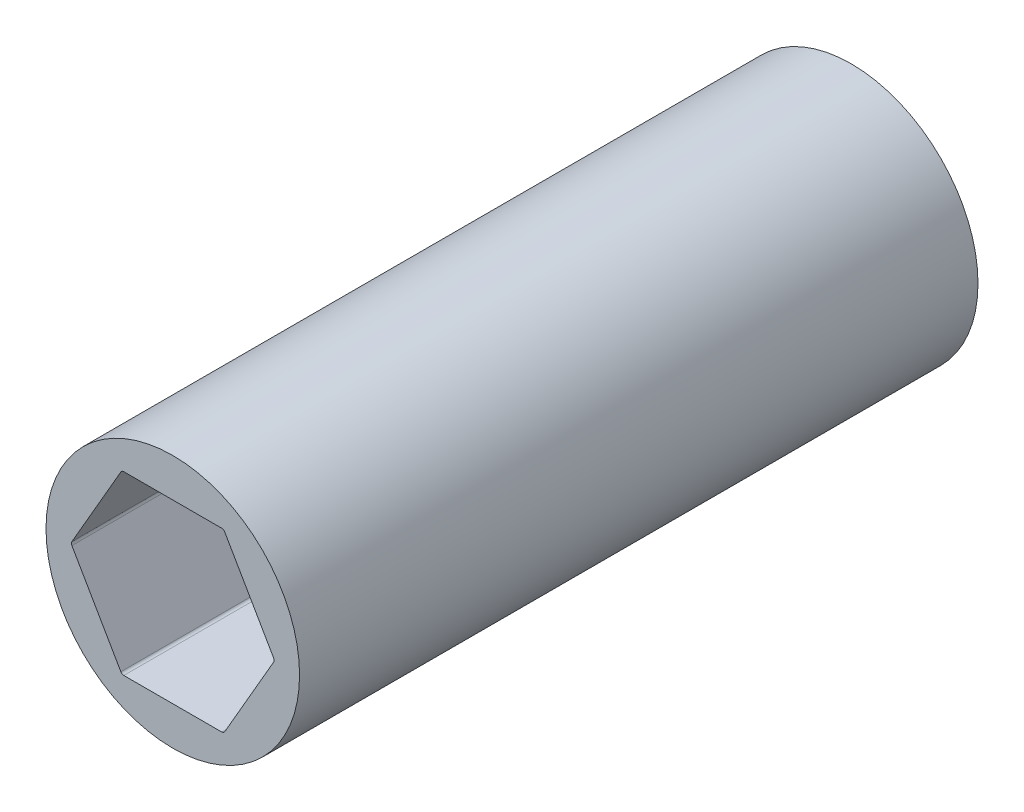
ISO-10303-21;
HEADER;
FILE_DESCRIPTION(('STEP AP214'),'2;1');
FILE_NAME('part.step','',(''),(''),'','','');
FILE_SCHEMA(('AUTOMOTIVE_DESIGN { 1 0 10303 214 1 1 1 1 }'));
ENDSEC;
DATA;
#1=APPLICATION_CONTEXT('core data for automotive mechanical design processes');
#2=APPLICATION_PROTOCOL_DEFINITION('international standard','automotive_design',2000,#1);
#3=PRODUCT_CONTEXT('',#1,'mechanical');
#4=PRODUCT('Part','Part','',(#3));
#5=PRODUCT_RELATED_PRODUCT_CATEGORY('part','',(#4));
#6=PRODUCT_DEFINITION_FORMATION('','',#4);
#7=PRODUCT_DEFINITION_CONTEXT('part definition',#1,'design');
#8=PRODUCT_DEFINITION('design','',#6,#7);
#9=PRODUCT_DEFINITION_SHAPE('','',#8);
#10=(LENGTH_UNIT() NAMED_UNIT(*) SI_UNIT(.MILLI.,.METRE.));
#11=(NAMED_UNIT(*) PLANE_ANGLE_UNIT() SI_UNIT($,.RADIAN.));
#12=(NAMED_UNIT(*) SI_UNIT($,.STERADIAN.) SOLID_ANGLE_UNIT());
#13=UNCERTAINTY_MEASURE_WITH_UNIT(LENGTH_MEASURE(1.E-05),#10,'distance_accuracy_value','');
#14=(GEOMETRIC_REPRESENTATION_CONTEXT(3) GLOBAL_UNCERTAINTY_ASSIGNED_CONTEXT((#13)) GLOBAL_UNIT_ASSIGNED_CONTEXT((#10,
#11,#12)) REPRESENTATION_CONTEXT('',''));
#15=CARTESIAN_POINT('',(0.,0.,0.));
#16=DIRECTION('',(0.,0.,1.));
#17=DIRECTION('',(1.,0.,0.));
#18=AXIS2_PLACEMENT_3D('',#15,#16,#17);
#19=CARTESIAN_POINT('',(7.25902493452117,0.,30.48));
#20=DIRECTION('',(0.,0.,1.));
#21=DIRECTION('',(1.,0.,0.));
#22=AXIS2_PLACEMENT_3D('',#19,#20,#21);
#23=CYLINDRICAL_SURFACE('',#22,0.254);
#24=CARTESIAN_POINT('',(7.25902493452117,0.,0.));
#25=DIRECTION('',(0.,0.,1.));
#26=DIRECTION('',(1.,0.,0.));
#27=AXIS2_PLACEMENT_3D('',#24,#25,#26);
#28=CIRCLE('',#27,0.254);
#29=CARTESIAN_POINT('',(7.51302493452117,0.,0.));
#30=VERTEX_POINT('',#29);
#31=CARTESIAN_POINT('',(7.47899538708242,0.127,0.));
#32=VERTEX_POINT('',#31);
#33=EDGE_CURVE('E67',#30,#32,#28,.T.);
#34=ORIENTED_EDGE('',*,*,#33,.F.);
#35=DIRECTION('',(0.,0.,1.));
#36=VECTOR('',#35,1.);
#37=CARTESIAN_POINT('',(7.51302493452117,0.,30.48));
#38=LINE('',#37,#36);
#39=CARTESIAN_POINT('',(7.51302493452117,0.,30.48));
#40=VERTEX_POINT('',#39);
#41=EDGE_CURVE('E11',#30,#40,#38,.T.);
#42=ORIENTED_EDGE('',*,*,#41,.T.);
#43=ORIENTED_EDGE('',*,*,#41,.F.);
#44=CARTESIAN_POINT('',(7.25902493452117,0.,0.));
#45=DIRECTION('',(0.,0.,1.));
#46=DIRECTION('',(1.,0.,0.));
#47=AXIS2_PLACEMENT_3D('',#44,#45,#46);
#48=CIRCLE('',#47,0.254);
#49=CARTESIAN_POINT('',(7.47899538708242,-0.127000000000001,0.));
#50=VERTEX_POINT('',#49);
#51=EDGE_CURVE('E150',#50,#30,#48,.T.);
#52=ORIENTED_EDGE('',*,*,#51,.F.);
#53=DIRECTION('',(0.,0.,-1.));
#54=VECTOR('',#53,1.);
#55=CARTESIAN_POINT('',(7.47899538708242,-0.127,0.));
#56=LINE('',#55,#54);
#57=CARTESIAN_POINT('',(7.47899538708242,-0.127000000000002,50.292));
#58=VERTEX_POINT('',#57);
#59=EDGE_CURVE('E128',#58,#50,#56,.T.);
#60=ORIENTED_EDGE('',*,*,#59,.F.);
#61=CARTESIAN_POINT('',(7.25902493452117,0.,50.292));
#62=DIRECTION('',(0.,0.,1.));
#63=DIRECTION('',(-1.,0.,0.));
#64=AXIS2_PLACEMENT_3D('',#61,#62,#63);
#65=CIRCLE('',#64,0.254000000000002);
#66=CARTESIAN_POINT('',(7.47899538708242,0.127,50.292));
#67=VERTEX_POINT('',#66);
#68=EDGE_CURVE('E659',#58,#67,#65,.T.);
#69=ORIENTED_EDGE('',*,*,#68,.T.);
#70=DIRECTION('',(0.,0.,1.));
#71=VECTOR('',#70,1.);
#72=CARTESIAN_POINT('',(7.47899538708242,0.127,30.48));
#73=LINE('',#72,#71);
#74=EDGE_CURVE('E160',#32,#67,#73,.T.);
#75=ORIENTED_EDGE('',*,*,#74,.F.);
#76=EDGE_LOOP('',(#34,#42,#43,#52,#60,#69,#75));
#77=FACE_BOUND('',#76,.T.);
#78=ADVANCED_FACE('F43',(#77),#23,.F.);
#79=CARTESIAN_POINT('',(0.,0.,30.48));
#80=DIRECTION('',(0.,0.,-1.));
#81=DIRECTION('',(-1.,0.,0.));
#82=AXIS2_PLACEMENT_3D('',#79,#80,#81);
#83=CYLINDRICAL_SURFACE('',#82,9.398);
#84=DIRECTION('',(0.,0.,-1.));
#85=VECTOR('',#84,1.);
#86=CARTESIAN_POINT('',(-9.398,0.,30.48));
#87=LINE('',#86,#85);
#88=CARTESIAN_POINT('',(-9.398,0.,30.48));
#89=VERTEX_POINT('',#88);
#90=CARTESIAN_POINT('',(-9.398,0.,0.));
#91=VERTEX_POINT('',#90);
#92=EDGE_CURVE('E104',#89,#91,#87,.T.);
#93=ORIENTED_EDGE('',*,*,#92,.F.);
#94=ORIENTED_EDGE('',*,*,#92,.T.);
#95=CARTESIAN_POINT('',(0.,0.,0.));
#96=DIRECTION('',(0.,0.,1.));
#97=DIRECTION('',(1.,0.,0.));
#98=AXIS2_PLACEMENT_3D('',#95,#96,#97);
#99=CIRCLE('',#98,9.398);
#100=CARTESIAN_POINT('',(9.398,0.,0.));
#101=VERTEX_POINT('',#100);
#102=EDGE_CURVE('E109',#91,#101,#99,.T.);
#103=ORIENTED_EDGE('',*,*,#102,.T.);
#104=DIRECTION('',(0.,0.,-1.));
#105=VECTOR('',#104,1.);
#106=CARTESIAN_POINT('',(9.398,0.,30.48));
#107=LINE('',#106,#105);
#108=CARTESIAN_POINT('',(9.398,0.,30.48));
#109=VERTEX_POINT('',#108);
#110=EDGE_CURVE('E54',#109,#101,#107,.T.);
#111=ORIENTED_EDGE('',*,*,#110,.F.);
#112=ORIENTED_EDGE('',*,*,#110,.T.);
#113=CARTESIAN_POINT('',(0.,0.,0.));
#114=DIRECTION('',(0.,0.,1.));
#115=DIRECTION('',(1.,0.,0.));
#116=AXIS2_PLACEMENT_3D('',#113,#114,#115);
#117=CIRCLE('',#116,9.398);
#118=EDGE_CURVE('E115',#101,#91,#117,.T.);
#119=ORIENTED_EDGE('',*,*,#118,.T.);
#120=EDGE_LOOP('',(#93,#94,#103,#111,#112,#119));
#121=FACE_BOUND('',#120,.T.);
#122=CARTESIAN_POINT('',(0.,0.,50.292));
#123=DIRECTION('',(0.,0.,1.));
#124=DIRECTION('',(1.,0.,0.));
#125=AXIS2_PLACEMENT_3D('',#122,#123,#124);
#126=CIRCLE('',#125,9.398);
#127=CARTESIAN_POINT('',(9.398,0.,50.292));
#128=VERTEX_POINT('',#127);
#129=EDGE_CURVE('E614',#128,#128,#126,.T.);
#130=ORIENTED_EDGE('',*,*,#129,.F.);
#131=EDGE_LOOP('',(#130));
#132=FACE_BOUND('',#131,.T.);
#133=ADVANCED_FACE('F106',(#121,#132),#83,.T.);
#134=CARTESIAN_POINT('',(0.,0.,0.));
#135=DIRECTION('',(0.,0.,1.));
#136=DIRECTION('',(1.,0.,0.));
#137=AXIS2_PLACEMENT_3D('',#134,#135,#136);
#138=PLANE('',#137);
#139=ORIENTED_EDGE('',*,*,#102,.F.);
#140=ORIENTED_EDGE('',*,*,#118,.F.);
#141=EDGE_LOOP('',(#139,#140));
#142=FACE_BOUND('',#141,.T.);
#143=DIRECTION('',(1.,0.,0.));
#144=VECTOR('',#143,1.);
#145=CARTESIAN_POINT('',(-3.77615943563474,-6.5405,0.));
#146=LINE('',#145,#144);
#147=CARTESIAN_POINT('',(-3.62951246726058,-6.5405,0.));
#148=VERTEX_POINT('',#147);
#149=CARTESIAN_POINT('',(3.62951246726058,-6.5405,0.));
#150=VERTEX_POINT('',#149);
#151=EDGE_CURVE('E118',#148,#150,#146,.T.);
#152=ORIENTED_EDGE('',*,*,#151,.T.);
#153=CARTESIAN_POINT('',(3.62951246726059,-6.2865,0.));
#154=DIRECTION('',(0.,0.,1.));
#155=DIRECTION('',(1.,0.,0.));
#156=AXIS2_PLACEMENT_3D('',#153,#154,#155);
#157=CIRCLE('',#156,0.254);
#158=CARTESIAN_POINT('',(3.84948291982184,-6.4135,0.));
#159=VERTEX_POINT('',#158);
#160=EDGE_CURVE('E149',#150,#159,#157,.T.);
#161=ORIENTED_EDGE('',*,*,#160,.T.);
#162=DIRECTION('',(0.5,0.866025403784439,0.));
#163=VECTOR('',#162,1.);
#164=CARTESIAN_POINT('',(3.77615943563475,-6.5405,0.));
#165=LINE('',#164,#163);
#166=EDGE_CURVE('E145',#159,#50,#165,.T.);
#167=ORIENTED_EDGE('',*,*,#166,.T.);
#168=ORIENTED_EDGE('',*,*,#51,.T.);
#169=ORIENTED_EDGE('',*,*,#33,.T.);
#170=DIRECTION('',(-0.5,0.866025403784438,0.));
#171=VECTOR('',#170,1.);
#172=CARTESIAN_POINT('',(7.5523188712695,0.,0.));
#173=LINE('',#172,#171);
#174=CARTESIAN_POINT('',(3.84948291982183,6.4135,0.));
#175=VERTEX_POINT('',#174);
#176=EDGE_CURVE('E140',#32,#175,#173,.T.);
#177=ORIENTED_EDGE('',*,*,#176,.T.);
#178=CARTESIAN_POINT('',(3.62951246726058,6.2865,0.));
#179=DIRECTION('',(0.,0.,1.));
#180=DIRECTION('',(1.,0.,0.));
#181=AXIS2_PLACEMENT_3D('',#178,#179,#180);
#182=CIRCLE('',#181,0.254);
#183=CARTESIAN_POINT('',(3.62951246726058,6.5405,0.));
#184=VERTEX_POINT('',#183);
#185=EDGE_CURVE('E144',#175,#184,#182,.T.);
#186=ORIENTED_EDGE('',*,*,#185,.T.);
#187=DIRECTION('',(-1.,0.,0.));
#188=VECTOR('',#187,1.);
#189=CARTESIAN_POINT('',(3.77615943563475,6.5405,0.));
#190=LINE('',#189,#188);
#191=CARTESIAN_POINT('',(-3.62951246726058,6.5405,0.));
#192=VERTEX_POINT('',#191);
#193=EDGE_CURVE('E138',#184,#192,#190,.T.);
#194=ORIENTED_EDGE('',*,*,#193,.T.);
#195=CARTESIAN_POINT('',(-3.62951246726058,6.2865,0.));
#196=DIRECTION('',(0.,0.,1.));
#197=DIRECTION('',(1.,0.,0.));
#198=AXIS2_PLACEMENT_3D('',#195,#196,#197);
#199=CIRCLE('',#198,0.254);
#200=CARTESIAN_POINT('',(-3.84948291982183,6.4135,0.));
#201=VERTEX_POINT('',#200);
#202=EDGE_CURVE('E134',#192,#201,#199,.T.);
#203=ORIENTED_EDGE('',*,*,#202,.T.);
#204=DIRECTION('',(-0.5,-0.866025403784439,0.));
#205=VECTOR('',#204,1.);
#206=CARTESIAN_POINT('',(-3.77615943563474,6.5405,0.));
#207=LINE('',#206,#205);
#208=CARTESIAN_POINT('',(-7.47899538708241,0.127000000000003,0.));
#209=VERTEX_POINT('',#208);
#210=EDGE_CURVE('E139',#201,#209,#207,.T.);
#211=ORIENTED_EDGE('',*,*,#210,.T.);
#212=CARTESIAN_POINT('',(-7.25902493452117,0.,0.));
#213=DIRECTION('',(0.,0.,1.));
#214=DIRECTION('',(1.,0.,0.));
#215=AXIS2_PLACEMENT_3D('',#212,#213,#214);
#216=CIRCLE('',#215,0.254);
#217=CARTESIAN_POINT('',(-7.47899538708241,-0.126999999999999,0.));
#218=VERTEX_POINT('',#217);
#219=EDGE_CURVE('E151',#209,#218,#216,.T.);
#220=ORIENTED_EDGE('',*,*,#219,.T.);
#221=DIRECTION('',(0.5,-0.866025403784439,0.));
#222=VECTOR('',#221,1.);
#223=CARTESIAN_POINT('',(-7.5523188712695,0.,0.));
#224=LINE('',#223,#222);
#225=CARTESIAN_POINT('',(-3.84948291982183,-6.4135,0.));
#226=VERTEX_POINT('',#225);
#227=EDGE_CURVE('E155',#218,#226,#224,.T.);
#228=ORIENTED_EDGE('',*,*,#227,.T.);
#229=CARTESIAN_POINT('',(-3.62951246726058,-6.2865,0.));
#230=DIRECTION('',(0.,0.,1.));
#231=DIRECTION('',(1.,0.,0.));
#232=AXIS2_PLACEMENT_3D('',#229,#230,#231);
#233=CIRCLE('',#232,0.254);
#234=EDGE_CURVE('E112',#226,#148,#233,.T.);
#235=ORIENTED_EDGE('',*,*,#234,.T.);
#236=EDGE_LOOP('',(#152,#161,#167,#168,#169,#177,#186,#194,#203,#211,#220,#228,#235));
#237=FACE_BOUND('',#236,.T.);
#238=ADVANCED_FACE('F120',(#142,#237),#138,.F.);
#239=CARTESIAN_POINT('',(3.77615943563475,-6.5405,30.48));
#240=DIRECTION('',(-0.866025403784439,0.5,0.));
#241=DIRECTION('',(0.,0.,1.));
#242=AXIS2_PLACEMENT_3D('',#239,#240,#241);
#243=PLANE('',#242);
#244=ORIENTED_EDGE('',*,*,#166,.F.);
#245=DIRECTION('',(0.,0.,1.));
#246=VECTOR('',#245,1.);
#247=CARTESIAN_POINT('',(3.84948291982184,-6.4135,30.48));
#248=LINE('',#247,#246);
#249=CARTESIAN_POINT('',(3.84948291982184,-6.4135,50.292));
#250=VERTEX_POINT('',#249);
#251=EDGE_CURVE('E123',#159,#250,#248,.T.);
#252=ORIENTED_EDGE('',*,*,#251,.T.);
#253=DIRECTION('',(0.5,0.866025403784438,0.));
#254=VECTOR('',#253,1.);
#255=CARTESIAN_POINT('',(3.84948291982184,-6.4135,50.292));
#256=LINE('',#255,#254);
#257=EDGE_CURVE('E655',#250,#58,#256,.T.);
#258=ORIENTED_EDGE('',*,*,#257,.T.);
#259=ORIENTED_EDGE('',*,*,#59,.T.);
#260=EDGE_LOOP('',(#244,#252,#258,#259));
#261=FACE_BOUND('',#260,.T.);
#262=ADVANCED_FACE('F301',(#261),#243,.T.);
#263=CARTESIAN_POINT('',(7.5523188712695,0.,30.48));
#264=DIRECTION('',(-0.866025403784438,-0.5,0.));
#265=DIRECTION('',(-0.5,0.866025403784438,0.));
#266=AXIS2_PLACEMENT_3D('',#263,#264,#265);
#267=PLANE('',#266);
#268=ORIENTED_EDGE('',*,*,#74,.T.);
#269=DIRECTION('',(-0.500000000000001,0.866025403784438,0.));
#270=VECTOR('',#269,1.);
#271=CARTESIAN_POINT('',(7.47899538708242,0.127,50.292));
#272=LINE('',#271,#270);
#273=CARTESIAN_POINT('',(3.84948291982183,6.4135,50.292));
#274=VERTEX_POINT('',#273);
#275=EDGE_CURVE('E663',#67,#274,#272,.T.);
#276=ORIENTED_EDGE('',*,*,#275,.T.);
#277=DIRECTION('',(0.,0.,-1.));
#278=VECTOR('',#277,1.);
#279=CARTESIAN_POINT('',(3.84948291982183,6.4135,0.));
#280=LINE('',#279,#278);
#281=EDGE_CURVE('E162',#274,#175,#280,.T.);
#282=ORIENTED_EDGE('',*,*,#281,.T.);
#283=ORIENTED_EDGE('',*,*,#176,.F.);
#284=EDGE_LOOP('',(#268,#276,#282,#283));
#285=FACE_BOUND('',#284,.T.);
#286=ADVANCED_FACE('F305',(#285),#267,.T.);
#287=CARTESIAN_POINT('',(3.77615943563475,6.5405,30.48));
#288=DIRECTION('',(0.,-1.,0.));
#289=DIRECTION('',(0.,0.,-1.));
#290=AXIS2_PLACEMENT_3D('',#287,#288,#289);
#291=PLANE('',#290);
#292=ORIENTED_EDGE('',*,*,#193,.F.);
#293=DIRECTION('',(0.,0.,1.));
#294=VECTOR('',#293,1.);
#295=CARTESIAN_POINT('',(3.62951246726058,6.5405,30.48));
#296=LINE('',#295,#294);
#297=CARTESIAN_POINT('',(3.62951246726058,6.5405,50.292));
#298=VERTEX_POINT('',#297);
#299=EDGE_CURVE('E156',#184,#298,#296,.T.);
#300=ORIENTED_EDGE('',*,*,#299,.T.);
#301=DIRECTION('',(-1.,0.,0.));
#302=VECTOR('',#301,1.);
#303=CARTESIAN_POINT('',(3.62951246726058,6.5405,50.292));
#304=LINE('',#303,#302);
#305=CARTESIAN_POINT('',(-3.62951246726058,6.5405,50.292));
#306=VERTEX_POINT('',#305);
#307=EDGE_CURVE('E671',#298,#306,#304,.T.);
#308=ORIENTED_EDGE('',*,*,#307,.T.);
#309=DIRECTION('',(0.,0.,-1.));
#310=VECTOR('',#309,1.);
#311=CARTESIAN_POINT('',(-3.62951246726058,6.5405,0.));
#312=LINE('',#311,#310);
#313=EDGE_CURVE('E161',#306,#192,#312,.T.);
#314=ORIENTED_EDGE('',*,*,#313,.T.);
#315=EDGE_LOOP('',(#292,#300,#308,#314));
#316=FACE_BOUND('',#315,.T.);
#317=ADVANCED_FACE('F295',(#316),#291,.T.);
#318=CARTESIAN_POINT('',(-3.77615943563474,6.5405,30.48));
#319=DIRECTION('',(0.866025403784439,-0.5,0.));
#320=DIRECTION('',(0.,0.,-1.));
#321=AXIS2_PLACEMENT_3D('',#318,#319,#320);
#322=PLANE('',#321);
#323=ORIENTED_EDGE('',*,*,#210,.F.);
#324=DIRECTION('',(0.,0.,1.));
#325=VECTOR('',#324,1.);
#326=CARTESIAN_POINT('',(-3.84948291982183,6.4135,30.48));
#327=LINE('',#326,#325);
#328=CARTESIAN_POINT('',(-3.84948291982183,6.4135,50.292));
#329=VERTEX_POINT('',#328);
#330=EDGE_CURVE('E680',#201,#329,#327,.T.);
#331=ORIENTED_EDGE('',*,*,#330,.T.);
#332=DIRECTION('',(-0.5,-0.866025403784439,0.));
#333=VECTOR('',#332,1.);
#334=CARTESIAN_POINT('',(-3.84948291982183,6.4135,50.292));
#335=LINE('',#334,#333);
#336=CARTESIAN_POINT('',(-7.47899538708241,0.127000000000003,50.292));
#337=VERTEX_POINT('',#336);
#338=EDGE_CURVE('E620',#329,#337,#335,.T.);
#339=ORIENTED_EDGE('',*,*,#338,.T.);
#340=DIRECTION('',(0.,0.,-1.));
#341=VECTOR('',#340,1.);
#342=CARTESIAN_POINT('',(-7.47899538708241,0.127000000000002,0.));
#343=LINE('',#342,#341);
#344=EDGE_CURVE('E266',#337,#209,#343,.T.);
#345=ORIENTED_EDGE('',*,*,#344,.T.);
#346=EDGE_LOOP('',(#323,#331,#339,#345));
#347=FACE_BOUND('',#346,.T.);
#348=ADVANCED_FACE('F290',(#347),#322,.T.);
#349=CARTESIAN_POINT('',(-7.5523188712695,0.,30.48));
#350=DIRECTION('',(0.866025403784439,0.5,0.));
#351=DIRECTION('',(0.,0.,-1.));
#352=AXIS2_PLACEMENT_3D('',#349,#350,#351);
#353=PLANE('',#352);
#354=DIRECTION('',(0.,0.,1.));
#355=VECTOR('',#354,1.);
#356=CARTESIAN_POINT('',(-7.47899538708241,-0.126999999999998,30.48));
#357=LINE('',#356,#355);
#358=CARTESIAN_POINT('',(-7.47899538708241,-0.126999999999996,50.292));
#359=VERTEX_POINT('',#358);
#360=EDGE_CURVE('E267',#218,#359,#357,.T.);
#361=ORIENTED_EDGE('',*,*,#360,.T.);
#362=DIRECTION('',(0.500000000000001,-0.866025403784438,0.));
#363=VECTOR('',#362,1.);
#364=CARTESIAN_POINT('',(-7.47899538708241,-0.126999999999995,50.292));
#365=LINE('',#364,#363);
#366=CARTESIAN_POINT('',(-3.84948291982182,-6.4135,50.292));
#367=VERTEX_POINT('',#366);
#368=EDGE_CURVE('E636',#359,#367,#365,.T.);
#369=ORIENTED_EDGE('',*,*,#368,.T.);
#370=DIRECTION('',(0.,0.,-1.));
#371=VECTOR('',#370,1.);
#372=CARTESIAN_POINT('',(-3.84948291982183,-6.4135,0.));
#373=LINE('',#372,#371);
#374=EDGE_CURVE('E261',#367,#226,#373,.T.);
#375=ORIENTED_EDGE('',*,*,#374,.T.);
#376=ORIENTED_EDGE('',*,*,#227,.F.);
#377=EDGE_LOOP('',(#361,#369,#375,#376));
#378=FACE_BOUND('',#377,.T.);
#379=ADVANCED_FACE('F294',(#378),#353,.T.);
#380=CARTESIAN_POINT('',(-3.77615943563474,-6.5405,30.48));
#381=DIRECTION('',(0.,1.,0.));
#382=DIRECTION('',(1.,0.,0.));
#383=AXIS2_PLACEMENT_3D('',#380,#381,#382);
#384=PLANE('',#383);
#385=ORIENTED_EDGE('',*,*,#151,.F.);
#386=DIRECTION('',(0.,0.,1.));
#387=VECTOR('',#386,1.);
#388=CARTESIAN_POINT('',(-3.62951246726058,-6.5405,30.48));
#389=LINE('',#388,#387);
#390=CARTESIAN_POINT('',(-3.62951246726058,-6.5405,50.292));
#391=VERTEX_POINT('',#390);
#392=EDGE_CURVE('E132',#148,#391,#389,.T.);
#393=ORIENTED_EDGE('',*,*,#392,.T.);
#394=DIRECTION('',(1.,0.,0.));
#395=VECTOR('',#394,1.);
#396=CARTESIAN_POINT('',(-3.62951246726058,-6.5405,50.292));
#397=LINE('',#396,#395);
#398=CARTESIAN_POINT('',(3.62951246726058,-6.5405,50.292));
#399=VERTEX_POINT('',#398);
#400=EDGE_CURVE('E647',#391,#399,#397,.T.);
#401=ORIENTED_EDGE('',*,*,#400,.T.);
#402=DIRECTION('',(0.,0.,-1.));
#403=VECTOR('',#402,1.);
#404=CARTESIAN_POINT('',(3.62951246726059,-6.5405,0.));
#405=LINE('',#404,#403);
#406=EDGE_CURVE('E274',#399,#150,#405,.T.);
#407=ORIENTED_EDGE('',*,*,#406,.T.);
#408=EDGE_LOOP('',(#385,#393,#401,#407));
#409=FACE_BOUND('',#408,.T.);
#410=ADVANCED_FACE('F356',(#409),#384,.T.);
#411=CARTESIAN_POINT('',(3.62951246726058,6.2865,30.48));
#412=DIRECTION('',(0.,0.,1.));
#413=DIRECTION('',(1.,0.,0.));
#414=AXIS2_PLACEMENT_3D('',#411,#412,#413);
#415=CYLINDRICAL_SURFACE('',#414,0.254);
#416=ORIENTED_EDGE('',*,*,#281,.F.);
#417=CARTESIAN_POINT('',(3.62951246726058,6.2865,50.292));
#418=DIRECTION('',(0.,0.,1.));
#419=DIRECTION('',(1.,0.,0.));
#420=AXIS2_PLACEMENT_3D('',#417,#418,#419);
#421=CIRCLE('',#420,0.254000000000001);
#422=EDGE_CURVE('E667',#274,#298,#421,.T.);
#423=ORIENTED_EDGE('',*,*,#422,.T.);
#424=ORIENTED_EDGE('',*,*,#299,.F.);
#425=ORIENTED_EDGE('',*,*,#185,.F.);
#426=EDGE_LOOP('',(#416,#423,#424,#425));
#427=FACE_BOUND('',#426,.T.);
#428=ADVANCED_FACE('F316',(#427),#415,.F.);
#429=CARTESIAN_POINT('',(-3.62951246726058,6.2865,30.48));
#430=DIRECTION('',(0.,0.,1.));
#431=DIRECTION('',(1.,0.,0.));
#432=AXIS2_PLACEMENT_3D('',#429,#430,#431);
#433=CYLINDRICAL_SURFACE('',#432,0.254);
#434=ORIENTED_EDGE('',*,*,#313,.F.);
#435=CARTESIAN_POINT('',(-3.62951246726058,6.2865,50.292));
#436=DIRECTION('',(0.,0.,1.));
#437=DIRECTION('',(-1.,0.,0.));
#438=AXIS2_PLACEMENT_3D('',#435,#436,#437);
#439=CIRCLE('',#438,0.254000000000001);
#440=EDGE_CURVE('E624',#306,#329,#439,.T.);
#441=ORIENTED_EDGE('',*,*,#440,.T.);
#442=ORIENTED_EDGE('',*,*,#330,.F.);
#443=ORIENTED_EDGE('',*,*,#202,.F.);
#444=EDGE_LOOP('',(#434,#441,#442,#443));
#445=FACE_BOUND('',#444,.T.);
#446=ADVANCED_FACE('F311',(#445),#433,.F.);
#447=CARTESIAN_POINT('',(-3.62951246726058,-6.2865,30.48));
#448=DIRECTION('',(0.,0.,1.));
#449=DIRECTION('',(1.,0.,0.));
#450=AXIS2_PLACEMENT_3D('',#447,#448,#449);
#451=CYLINDRICAL_SURFACE('',#450,0.254);
#452=ORIENTED_EDGE('',*,*,#374,.F.);
#453=CARTESIAN_POINT('',(-3.62951246726058,-6.2865,50.292));
#454=DIRECTION('',(0.,0.,1.));
#455=DIRECTION('',(-1.,0.,0.));
#456=AXIS2_PLACEMENT_3D('',#453,#454,#455);
#457=CIRCLE('',#456,0.253999999999996);
#458=EDGE_CURVE('E643',#367,#391,#457,.T.);
#459=ORIENTED_EDGE('',*,*,#458,.T.);
#460=ORIENTED_EDGE('',*,*,#392,.F.);
#461=ORIENTED_EDGE('',*,*,#234,.F.);
#462=EDGE_LOOP('',(#452,#459,#460,#461));
#463=FACE_BOUND('',#462,.T.);
#464=ADVANCED_FACE('F315',(#463),#451,.F.);
#465=CARTESIAN_POINT('',(3.62951246726059,-6.2865,30.48));
#466=DIRECTION('',(0.,0.,1.));
#467=DIRECTION('',(1.,0.,0.));
#468=AXIS2_PLACEMENT_3D('',#465,#466,#467);
#469=CYLINDRICAL_SURFACE('',#468,0.254);
#470=ORIENTED_EDGE('',*,*,#406,.F.);
#471=CARTESIAN_POINT('',(3.62951246726059,-6.2865,50.292));
#472=DIRECTION('',(0.,0.,1.));
#473=DIRECTION('',(-1.,0.,0.));
#474=AXIS2_PLACEMENT_3D('',#471,#472,#473);
#475=CIRCLE('',#474,0.253999999999998);
#476=EDGE_CURVE('E651',#399,#250,#475,.T.);
#477=ORIENTED_EDGE('',*,*,#476,.T.);
#478=ORIENTED_EDGE('',*,*,#251,.F.);
#479=ORIENTED_EDGE('',*,*,#160,.F.);
#480=EDGE_LOOP('',(#470,#477,#478,#479));
#481=FACE_BOUND('',#480,.T.);
#482=ADVANCED_FACE('F344',(#481),#469,.F.);
#483=CARTESIAN_POINT('',(-7.25902493452117,0.,30.48));
#484=DIRECTION('',(0.,0.,1.));
#485=DIRECTION('',(1.,0.,0.));
#486=AXIS2_PLACEMENT_3D('',#483,#484,#485);
#487=CYLINDRICAL_SURFACE('',#486,0.254);
#488=ORIENTED_EDGE('',*,*,#344,.F.);
#489=CARTESIAN_POINT('',(-7.25902493452117,0.,50.292));
#490=DIRECTION('',(0.,0.,1.));
#491=DIRECTION('',(1.,0.,0.));
#492=AXIS2_PLACEMENT_3D('',#489,#490,#491);
#493=CIRCLE('',#492,0.253999999999994);
#494=EDGE_CURVE('E628',#337,#359,#493,.T.);
#495=ORIENTED_EDGE('',*,*,#494,.T.);
#496=ORIENTED_EDGE('',*,*,#360,.F.);
#497=ORIENTED_EDGE('',*,*,#219,.F.);
#498=EDGE_LOOP('',(#488,#495,#496,#497));
#499=FACE_BOUND('',#498,.T.);
#500=ADVANCED_FACE('F45',(#499),#487,.F.);
#501=CARTESIAN_POINT('',(0.,0.,50.292));
#502=DIRECTION('',(0.,0.,1.));
#503=DIRECTION('',(1.,0.,0.));
#504=AXIS2_PLACEMENT_3D('',#501,#502,#503);
#505=PLANE('',#504);
#506=ORIENTED_EDGE('',*,*,#129,.T.);
#507=EDGE_LOOP('',(#506));
#508=FACE_BOUND('',#507,.T.);
#509=ORIENTED_EDGE('',*,*,#338,.F.);
#510=ORIENTED_EDGE('',*,*,#440,.F.);
#511=ORIENTED_EDGE('',*,*,#307,.F.);
#512=ORIENTED_EDGE('',*,*,#422,.F.);
#513=ORIENTED_EDGE('',*,*,#275,.F.);
#514=ORIENTED_EDGE('',*,*,#68,.F.);
#515=ORIENTED_EDGE('',*,*,#257,.F.);
#516=ORIENTED_EDGE('',*,*,#476,.F.);
#517=ORIENTED_EDGE('',*,*,#400,.F.);
#518=ORIENTED_EDGE('',*,*,#458,.F.);
#519=ORIENTED_EDGE('',*,*,#368,.F.);
#520=ORIENTED_EDGE('',*,*,#494,.F.);
#521=EDGE_LOOP('',(#509,#510,#511,#512,#513,#514,#515,#516,#517,#518,#519,#520));
#522=FACE_BOUND('',#521,.T.);
#523=ADVANCED_FACE('F403',(#508,#522),#505,.T.);
#524=CLOSED_SHELL('',(#78,#133,#238,#262,#286,#317,#348,#379,#410,#428,#446,#464,#482,#500,#523));
#525=MANIFOLD_SOLID_BREP('B2',#524);
#526=ADVANCED_BREP_SHAPE_REPRESENTATION('',(#18,#525),#14);
#527=SHAPE_DEFINITION_REPRESENTATION(#9,#526);
ENDSEC;
END-ISO-10303-21;
